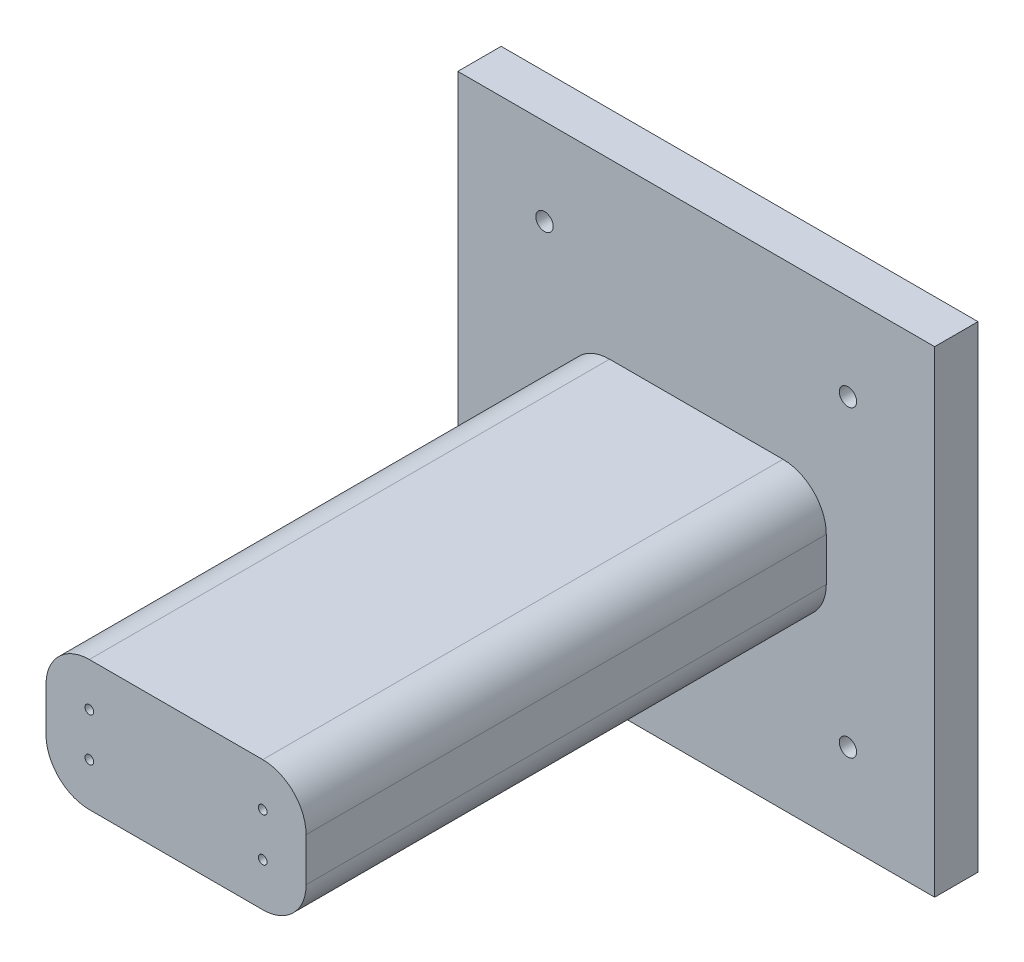
ISO-10303-21;
HEADER;
FILE_DESCRIPTION(('STEP AP214'),'2;1');
FILE_NAME('part.step','',(''),(''),'','','');
FILE_SCHEMA(('AUTOMOTIVE_DESIGN { 1 0 10303 214 1 1 1 1 }'));
ENDSEC;
DATA;
#1=APPLICATION_CONTEXT('core data for automotive mechanical design processes');
#2=APPLICATION_PROTOCOL_DEFINITION('international standard','automotive_design',2000,#1);
#3=PRODUCT_CONTEXT('',#1,'mechanical');
#4=PRODUCT('Part','Part','',(#3));
#5=PRODUCT_RELATED_PRODUCT_CATEGORY('part','',(#4));
#6=PRODUCT_DEFINITION_FORMATION('','',#4);
#7=PRODUCT_DEFINITION_CONTEXT('part definition',#1,'design');
#8=PRODUCT_DEFINITION('design','',#6,#7);
#9=PRODUCT_DEFINITION_SHAPE('','',#8);
#10=(LENGTH_UNIT() NAMED_UNIT(*) SI_UNIT(.MILLI.,.METRE.));
#11=(NAMED_UNIT(*) PLANE_ANGLE_UNIT() SI_UNIT($,.RADIAN.));
#12=(NAMED_UNIT(*) SI_UNIT($,.STERADIAN.) SOLID_ANGLE_UNIT());
#13=UNCERTAINTY_MEASURE_WITH_UNIT(LENGTH_MEASURE(1.E-05),#10,'distance_accuracy_value','');
#14=(GEOMETRIC_REPRESENTATION_CONTEXT(3) GLOBAL_UNCERTAINTY_ASSIGNED_CONTEXT((#13)) GLOBAL_UNIT_ASSIGNED_CONTEXT((#10,
#11,#12)) REPRESENTATION_CONTEXT('',''));
#15=CARTESIAN_POINT('',(0.,0.,0.));
#16=DIRECTION('',(0.,0.,1.));
#17=DIRECTION('',(1.,0.,0.));
#18=AXIS2_PLACEMENT_3D('',#15,#16,#17);
#19=CARTESIAN_POINT('',(-10.,2.5,65.));
#20=DIRECTION('',(0.,0.,-1.));
#21=DIRECTION('',(-1.,0.,0.));
#22=AXIS2_PLACEMENT_3D('',#19,#20,#21);
#23=CYLINDRICAL_SURFACE('',#22,5.);
#24=DIRECTION('',(0.,0.,-1.));
#25=VECTOR('',#24,1.);
#26=CARTESIAN_POINT('',(-15.,2.5,65.));
#27=LINE('',#26,#25);
#28=CARTESIAN_POINT('',(-15.,2.5,65.));
#29=VERTEX_POINT('',#28);
#30=CARTESIAN_POINT('',(-15.,2.5,5.));
#31=VERTEX_POINT('',#30);
#32=EDGE_CURVE('E202',#29,#31,#27,.T.);
#33=ORIENTED_EDGE('',*,*,#32,.F.);
#34=CARTESIAN_POINT('',(-10.,2.5,65.));
#35=DIRECTION('',(0.,0.,1.));
#36=DIRECTION('',(1.,0.,0.));
#37=AXIS2_PLACEMENT_3D('',#34,#35,#36);
#38=CIRCLE('',#37,5.);
#39=CARTESIAN_POINT('',(-10.,7.5,65.));
#40=VERTEX_POINT('',#39);
#41=EDGE_CURVE('E47',#40,#29,#38,.T.);
#42=ORIENTED_EDGE('',*,*,#41,.F.);
#43=DIRECTION('',(0.,0.,-1.));
#44=VECTOR('',#43,1.);
#45=CARTESIAN_POINT('',(-10.,7.5,65.));
#46=LINE('',#45,#44);
#47=CARTESIAN_POINT('',(-10.,7.5,5.));
#48=VERTEX_POINT('',#47);
#49=EDGE_CURVE('E206',#48,#40,#46,.F.);
#50=ORIENTED_EDGE('',*,*,#49,.F.);
#51=CARTESIAN_POINT('',(-10.,2.5,5.));
#52=DIRECTION('',(0.,0.,1.));
#53=DIRECTION('',(1.,0.,0.));
#54=AXIS2_PLACEMENT_3D('',#51,#52,#53);
#55=CIRCLE('',#54,5.);
#56=EDGE_CURVE('E11',#48,#31,#55,.T.);
#57=ORIENTED_EDGE('',*,*,#56,.T.);
#58=EDGE_LOOP('',(#33,#42,#50,#57));
#59=FACE_BOUND('',#58,.T.);
#60=ADVANCED_FACE('F39',(#59),#23,.T.);
#61=CARTESIAN_POINT('',(10.,-2.5,65.));
#62=DIRECTION('',(0.,0.,1.));
#63=DIRECTION('',(1.,0.,0.));
#64=AXIS2_PLACEMENT_3D('',#61,#62,#63);
#65=CYLINDRICAL_SURFACE('',#64,5.);
#66=DIRECTION('',(0.,0.,1.));
#67=VECTOR('',#66,1.);
#68=CARTESIAN_POINT('',(10.,-7.5,65.));
#69=LINE('',#68,#67);
#70=CARTESIAN_POINT('',(10.,-7.5,5.));
#71=VERTEX_POINT('',#70);
#72=CARTESIAN_POINT('',(10.,-7.5,65.));
#73=VERTEX_POINT('',#72);
#74=EDGE_CURVE('E188',#71,#73,#69,.T.);
#75=ORIENTED_EDGE('',*,*,#74,.F.);
#76=CARTESIAN_POINT('',(10.,-2.5,5.));
#77=DIRECTION('',(0.,0.,1.));
#78=DIRECTION('',(1.,0.,0.));
#79=AXIS2_PLACEMENT_3D('',#76,#77,#78);
#80=CIRCLE('',#79,5.);
#81=CARTESIAN_POINT('',(15.,-2.5,5.));
#82=VERTEX_POINT('',#81);
#83=EDGE_CURVE('E199',#71,#82,#80,.T.);
#84=ORIENTED_EDGE('',*,*,#83,.T.);
#85=DIRECTION('',(0.,0.,1.));
#86=VECTOR('',#85,1.);
#87=CARTESIAN_POINT('',(15.,-2.5,65.));
#88=LINE('',#87,#86);
#89=CARTESIAN_POINT('',(15.,-2.5,65.));
#90=VERTEX_POINT('',#89);
#91=EDGE_CURVE('E192',#90,#82,#88,.F.);
#92=ORIENTED_EDGE('',*,*,#91,.F.);
#93=CARTESIAN_POINT('',(10.,-2.5,65.));
#94=DIRECTION('',(0.,0.,1.));
#95=DIRECTION('',(1.,0.,0.));
#96=AXIS2_PLACEMENT_3D('',#93,#94,#95);
#97=CIRCLE('',#96,5.);
#98=EDGE_CURVE('E196',#73,#90,#97,.T.);
#99=ORIENTED_EDGE('',*,*,#98,.F.);
#100=EDGE_LOOP('',(#75,#84,#92,#99));
#101=FACE_BOUND('',#100,.T.);
#102=ADVANCED_FACE('F282',(#101),#65,.T.);
#103=CARTESIAN_POINT('',(10.,2.5,65.));
#104=DIRECTION('',(0.,0.,1.));
#105=DIRECTION('',(1.,0.,0.));
#106=AXIS2_PLACEMENT_3D('',#103,#104,#105);
#107=CYLINDRICAL_SURFACE('',#106,5.);
#108=DIRECTION('',(0.,0.,1.));
#109=VECTOR('',#108,1.);
#110=CARTESIAN_POINT('',(15.,2.5,65.));
#111=LINE('',#110,#109);
#112=CARTESIAN_POINT('',(15.,2.5,5.));
#113=VERTEX_POINT('',#112);
#114=CARTESIAN_POINT('',(15.,2.5,65.));
#115=VERTEX_POINT('',#114);
#116=EDGE_CURVE('E174',#113,#115,#111,.T.);
#117=ORIENTED_EDGE('',*,*,#116,.F.);
#118=CARTESIAN_POINT('',(10.,2.5,5.));
#119=DIRECTION('',(0.,0.,1.));
#120=DIRECTION('',(1.,0.,0.));
#121=AXIS2_PLACEMENT_3D('',#118,#119,#120);
#122=CIRCLE('',#121,5.);
#123=CARTESIAN_POINT('',(10.,7.5,5.));
#124=VERTEX_POINT('',#123);
#125=EDGE_CURVE('E185',#113,#124,#122,.T.);
#126=ORIENTED_EDGE('',*,*,#125,.T.);
#127=DIRECTION('',(0.,0.,1.));
#128=VECTOR('',#127,1.);
#129=CARTESIAN_POINT('',(10.,7.5,65.));
#130=LINE('',#129,#128);
#131=CARTESIAN_POINT('',(10.,7.5,65.));
#132=VERTEX_POINT('',#131);
#133=EDGE_CURVE('E178',#132,#124,#130,.F.);
#134=ORIENTED_EDGE('',*,*,#133,.F.);
#135=CARTESIAN_POINT('',(10.,2.5,65.));
#136=DIRECTION('',(0.,0.,1.));
#137=DIRECTION('',(1.,0.,0.));
#138=AXIS2_PLACEMENT_3D('',#135,#136,#137);
#139=CIRCLE('',#138,5.);
#140=EDGE_CURVE('E182',#115,#132,#139,.T.);
#141=ORIENTED_EDGE('',*,*,#140,.F.);
#142=EDGE_LOOP('',(#117,#126,#134,#141));
#143=FACE_BOUND('',#142,.T.);
#144=ADVANCED_FACE('F286',(#143),#107,.T.);
#145=CARTESIAN_POINT('',(-10.,-2.5,65.));
#146=DIRECTION('',(0.,0.,1.));
#147=DIRECTION('',(1.,0.,0.));
#148=AXIS2_PLACEMENT_3D('',#145,#146,#147);
#149=CYLINDRICAL_SURFACE('',#148,5.);
#150=DIRECTION('',(0.,0.,1.));
#151=VECTOR('',#150,1.);
#152=CARTESIAN_POINT('',(-15.,-2.5,65.));
#153=LINE('',#152,#151);
#154=CARTESIAN_POINT('',(-15.,-2.5,5.));
#155=VERTEX_POINT('',#154);
#156=CARTESIAN_POINT('',(-15.,-2.5,65.));
#157=VERTEX_POINT('',#156);
#158=EDGE_CURVE('E154',#155,#157,#153,.T.);
#159=ORIENTED_EDGE('',*,*,#158,.F.);
#160=CARTESIAN_POINT('',(-10.,-2.5,5.));
#161=DIRECTION('',(0.,0.,1.));
#162=DIRECTION('',(1.,0.,0.));
#163=AXIS2_PLACEMENT_3D('',#160,#161,#162);
#164=CIRCLE('',#163,5.);
#165=CARTESIAN_POINT('',(-10.,-7.5,5.));
#166=VERTEX_POINT('',#165);
#167=EDGE_CURVE('E171',#155,#166,#164,.T.);
#168=ORIENTED_EDGE('',*,*,#167,.T.);
#169=DIRECTION('',(0.,0.,1.));
#170=VECTOR('',#169,1.);
#171=CARTESIAN_POINT('',(-10.,-7.5,65.));
#172=LINE('',#171,#170);
#173=CARTESIAN_POINT('',(-10.,-7.5,65.));
#174=VERTEX_POINT('',#173);
#175=EDGE_CURVE('E159',#174,#166,#172,.F.);
#176=ORIENTED_EDGE('',*,*,#175,.F.);
#177=CARTESIAN_POINT('',(-10.,-2.5,65.));
#178=DIRECTION('',(0.,0.,1.));
#179=DIRECTION('',(1.,0.,0.));
#180=AXIS2_PLACEMENT_3D('',#177,#178,#179);
#181=CIRCLE('',#180,5.);
#182=EDGE_CURVE('E168',#157,#174,#181,.T.);
#183=ORIENTED_EDGE('',*,*,#182,.F.);
#184=EDGE_LOOP('',(#159,#168,#176,#183));
#185=FACE_BOUND('',#184,.T.);
#186=ADVANCED_FACE('F291',(#185),#149,.T.);
#187=CARTESIAN_POINT('',(27.5,27.5,5.));
#188=DIRECTION('',(-1.,0.,0.));
#189=DIRECTION('',(0.,-1.,0.));
#190=AXIS2_PLACEMENT_3D('',#187,#188,#189);
#191=PLANE('',#190);
#192=DIRECTION('',(0.,1.,0.));
#193=VECTOR('',#192,1.);
#194=CARTESIAN_POINT('',(27.5,27.5,0.));
#195=LINE('',#194,#193);
#196=CARTESIAN_POINT('',(27.5,-27.5,0.));
#197=VERTEX_POINT('',#196);
#198=CARTESIAN_POINT('',(27.5,27.5,0.));
#199=VERTEX_POINT('',#198);
#200=EDGE_CURVE('E152',#197,#199,#195,.T.);
#201=ORIENTED_EDGE('',*,*,#200,.T.);
#202=DIRECTION('',(0.,0.,-1.));
#203=VECTOR('',#202,1.);
#204=CARTESIAN_POINT('',(27.5,27.5,5.));
#205=LINE('',#204,#203);
#206=CARTESIAN_POINT('',(27.5,27.5,5.));
#207=VERTEX_POINT('',#206);
#208=EDGE_CURVE('E130',#207,#199,#205,.T.);
#209=ORIENTED_EDGE('',*,*,#208,.F.);
#210=DIRECTION('',(0.,1.,0.));
#211=VECTOR('',#210,1.);
#212=CARTESIAN_POINT('',(27.5,27.5,5.));
#213=LINE('',#212,#211);
#214=CARTESIAN_POINT('',(27.5,-27.5,5.));
#215=VERTEX_POINT('',#214);
#216=EDGE_CURVE('E138',#215,#207,#213,.T.);
#217=ORIENTED_EDGE('',*,*,#216,.F.);
#218=DIRECTION('',(0.,0.,-1.));
#219=VECTOR('',#218,1.);
#220=CARTESIAN_POINT('',(27.5,-27.5,5.));
#221=LINE('',#220,#219);
#222=EDGE_CURVE('E250',#215,#197,#221,.T.);
#223=ORIENTED_EDGE('',*,*,#222,.T.);
#224=EDGE_LOOP('',(#201,#209,#217,#223));
#225=FACE_BOUND('',#224,.T.);
#226=ADVANCED_FACE('F150',(#225),#191,.F.);
#227=CARTESIAN_POINT('',(-27.5,27.5,5.));
#228=DIRECTION('',(0.,-1.,0.));
#229=DIRECTION('',(0.,0.,-1.));
#230=AXIS2_PLACEMENT_3D('',#227,#228,#229);
#231=PLANE('',#230);
#232=DIRECTION('',(-1.,0.,0.));
#233=VECTOR('',#232,1.);
#234=CARTESIAN_POINT('',(-27.5,27.5,0.));
#235=LINE('',#234,#233);
#236=CARTESIAN_POINT('',(-27.5,27.5,0.));
#237=VERTEX_POINT('',#236);
#238=EDGE_CURVE('E253',#199,#237,#235,.T.);
#239=ORIENTED_EDGE('',*,*,#238,.T.);
#240=DIRECTION('',(0.,0.,-1.));
#241=VECTOR('',#240,1.);
#242=CARTESIAN_POINT('',(-27.5,27.5,5.));
#243=LINE('',#242,#241);
#244=CARTESIAN_POINT('',(-27.5,27.5,5.));
#245=VERTEX_POINT('',#244);
#246=EDGE_CURVE('E133',#245,#237,#243,.T.);
#247=ORIENTED_EDGE('',*,*,#246,.F.);
#248=DIRECTION('',(-1.,0.,0.));
#249=VECTOR('',#248,1.);
#250=CARTESIAN_POINT('',(-27.5,27.5,5.));
#251=LINE('',#250,#249);
#252=EDGE_CURVE('E126',#207,#245,#251,.T.);
#253=ORIENTED_EDGE('',*,*,#252,.F.);
#254=ORIENTED_EDGE('',*,*,#208,.T.);
#255=EDGE_LOOP('',(#239,#247,#253,#254));
#256=FACE_BOUND('',#255,.T.);
#257=ADVANCED_FACE('F128',(#256),#231,.F.);
#258=CARTESIAN_POINT('',(-27.5,27.5,5.));
#259=DIRECTION('',(1.,0.,0.));
#260=DIRECTION('',(0.,1.,0.));
#261=AXIS2_PLACEMENT_3D('',#258,#259,#260);
#262=PLANE('',#261);
#263=DIRECTION('',(0.,-1.,0.));
#264=VECTOR('',#263,1.);
#265=CARTESIAN_POINT('',(-27.5,27.5,0.));
#266=LINE('',#265,#264);
#267=CARTESIAN_POINT('',(-27.5,-27.5,0.));
#268=VERTEX_POINT('',#267);
#269=EDGE_CURVE('E256',#237,#268,#266,.T.);
#270=ORIENTED_EDGE('',*,*,#269,.T.);
#271=DIRECTION('',(0.,0.,-1.));
#272=VECTOR('',#271,1.);
#273=CARTESIAN_POINT('',(-27.5,-27.5,5.));
#274=LINE('',#273,#272);
#275=CARTESIAN_POINT('',(-27.5,-27.5,5.));
#276=VERTEX_POINT('',#275);
#277=EDGE_CURVE('E161',#276,#268,#274,.T.);
#278=ORIENTED_EDGE('',*,*,#277,.F.);
#279=DIRECTION('',(0.,-1.,0.));
#280=VECTOR('',#279,1.);
#281=CARTESIAN_POINT('',(-27.5,27.5,5.));
#282=LINE('',#281,#280);
#283=EDGE_CURVE('E137',#245,#276,#282,.T.);
#284=ORIENTED_EDGE('',*,*,#283,.F.);
#285=ORIENTED_EDGE('',*,*,#246,.T.);
#286=EDGE_LOOP('',(#270,#278,#284,#285));
#287=FACE_BOUND('',#286,.T.);
#288=ADVANCED_FACE('F272',(#287),#262,.F.);
#289=CARTESIAN_POINT('',(-27.5,-27.5,5.));
#290=DIRECTION('',(0.,1.,0.));
#291=DIRECTION('',(0.,0.,1.));
#292=AXIS2_PLACEMENT_3D('',#289,#290,#291);
#293=PLANE('',#292);
#294=DIRECTION('',(1.,0.,0.));
#295=VECTOR('',#294,1.);
#296=CARTESIAN_POINT('',(-27.5,-27.5,0.));
#297=LINE('',#296,#295);
#298=EDGE_CURVE('E148',#268,#197,#297,.T.);
#299=ORIENTED_EDGE('',*,*,#298,.T.);
#300=ORIENTED_EDGE('',*,*,#222,.F.);
#301=DIRECTION('',(1.,0.,0.));
#302=VECTOR('',#301,1.);
#303=CARTESIAN_POINT('',(-27.5,-27.5,5.));
#304=LINE('',#303,#302);
#305=EDGE_CURVE('E143',#276,#215,#304,.T.);
#306=ORIENTED_EDGE('',*,*,#305,.F.);
#307=ORIENTED_EDGE('',*,*,#277,.T.);
#308=EDGE_LOOP('',(#299,#300,#306,#307));
#309=FACE_BOUND('',#308,.T.);
#310=ADVANCED_FACE('F267',(#309),#293,.F.);
#311=CARTESIAN_POINT('',(0.,0.,5.));
#312=DIRECTION('',(0.,0.,1.));
#313=DIRECTION('',(1.,0.,0.));
#314=AXIS2_PLACEMENT_3D('',#311,#312,#313);
#315=PLANE('',#314);
#316=CARTESIAN_POINT('',(17.5,-17.5,5.));
#317=DIRECTION('',(0.,0.,1.));
#318=DIRECTION('',(1.,0.,0.));
#319=AXIS2_PLACEMENT_3D('',#316,#317,#318);
#320=CIRCLE('',#319,1.);
#321=CARTESIAN_POINT('',(18.5,-17.5,5.));
#322=VERTEX_POINT('',#321);
#323=EDGE_CURVE('E545',#322,#322,#320,.T.);
#324=ORIENTED_EDGE('',*,*,#323,.F.);
#325=EDGE_LOOP('',(#324));
#326=FACE_BOUND('',#325,.T.);
#327=CARTESIAN_POINT('',(-17.5,-17.5,5.));
#328=DIRECTION('',(0.,0.,1.));
#329=DIRECTION('',(1.,0.,0.));
#330=AXIS2_PLACEMENT_3D('',#327,#328,#329);
#331=CIRCLE('',#330,1.);
#332=CARTESIAN_POINT('',(-16.5,-17.5,5.));
#333=VERTEX_POINT('',#332);
#334=EDGE_CURVE('E561',#333,#333,#331,.T.);
#335=ORIENTED_EDGE('',*,*,#334,.F.);
#336=EDGE_LOOP('',(#335));
#337=FACE_BOUND('',#336,.T.);
#338=CARTESIAN_POINT('',(-17.5,17.5,5.));
#339=DIRECTION('',(0.,0.,1.));
#340=DIRECTION('',(1.,0.,0.));
#341=AXIS2_PLACEMENT_3D('',#338,#339,#340);
#342=CIRCLE('',#341,1.);
#343=CARTESIAN_POINT('',(-16.5,17.5,5.));
#344=VERTEX_POINT('',#343);
#345=EDGE_CURVE('E551',#344,#344,#342,.T.);
#346=ORIENTED_EDGE('',*,*,#345,.F.);
#347=EDGE_LOOP('',(#346));
#348=FACE_BOUND('',#347,.T.);
#349=CARTESIAN_POINT('',(17.5,17.5,5.));
#350=DIRECTION('',(0.,0.,1.));
#351=DIRECTION('',(1.,0.,0.));
#352=AXIS2_PLACEMENT_3D('',#349,#350,#351);
#353=CIRCLE('',#352,1.);
#354=CARTESIAN_POINT('',(18.5,17.5,5.));
#355=VERTEX_POINT('',#354);
#356=EDGE_CURVE('E560',#355,#355,#353,.T.);
#357=ORIENTED_EDGE('',*,*,#356,.F.);
#358=EDGE_LOOP('',(#357));
#359=FACE_BOUND('',#358,.T.);
#360=DIRECTION('',(0.,1.,0.));
#361=VECTOR('',#360,1.);
#362=CARTESIAN_POINT('',(15.,7.5,5.));
#363=LINE('',#362,#361);
#364=EDGE_CURVE('E231',#82,#113,#363,.T.);
#365=ORIENTED_EDGE('',*,*,#364,.F.);
#366=ORIENTED_EDGE('',*,*,#83,.F.);
#367=DIRECTION('',(1.,0.,0.));
#368=VECTOR('',#367,1.);
#369=CARTESIAN_POINT('',(-15.,-7.5,5.));
#370=LINE('',#369,#368);
#371=EDGE_CURVE('E242',#166,#71,#370,.T.);
#372=ORIENTED_EDGE('',*,*,#371,.F.);
#373=ORIENTED_EDGE('',*,*,#167,.F.);
#374=DIRECTION('',(0.,-1.,0.));
#375=VECTOR('',#374,1.);
#376=CARTESIAN_POINT('',(-15.,7.5,5.));
#377=LINE('',#376,#375);
#378=EDGE_CURVE('E239',#31,#155,#377,.T.);
#379=ORIENTED_EDGE('',*,*,#378,.F.);
#380=ORIENTED_EDGE('',*,*,#56,.F.);
#381=DIRECTION('',(-1.,0.,0.));
#382=VECTOR('',#381,1.);
#383=CARTESIAN_POINT('',(-15.,7.5,5.));
#384=LINE('',#383,#382);
#385=EDGE_CURVE('E234',#124,#48,#384,.T.);
#386=ORIENTED_EDGE('',*,*,#385,.F.);
#387=ORIENTED_EDGE('',*,*,#125,.F.);
#388=EDGE_LOOP('',(#365,#366,#372,#373,#379,#380,#386,#387));
#389=FACE_BOUND('',#388,.T.);
#390=ORIENTED_EDGE('',*,*,#216,.T.);
#391=ORIENTED_EDGE('',*,*,#252,.T.);
#392=ORIENTED_EDGE('',*,*,#283,.T.);
#393=ORIENTED_EDGE('',*,*,#305,.T.);
#394=EDGE_LOOP('',(#390,#391,#392,#393));
#395=FACE_BOUND('',#394,.T.);
#396=ADVANCED_FACE('F141',(#326,#337,#348,#359,#389,#395),#315,.T.);
#397=CARTESIAN_POINT('',(0.,0.,0.));
#398=DIRECTION('',(0.,0.,1.));
#399=DIRECTION('',(1.,0.,0.));
#400=AXIS2_PLACEMENT_3D('',#397,#398,#399);
#401=PLANE('',#400);
#402=CARTESIAN_POINT('',(17.5,-17.5,0.));
#403=DIRECTION('',(0.,0.,1.));
#404=DIRECTION('',(1.,0.,0.));
#405=AXIS2_PLACEMENT_3D('',#402,#403,#404);
#406=CIRCLE('',#405,1.);
#407=CARTESIAN_POINT('',(18.5,-17.5,0.));
#408=VERTEX_POINT('',#407);
#409=EDGE_CURVE('E565',#408,#408,#406,.F.);
#410=ORIENTED_EDGE('',*,*,#409,.F.);
#411=EDGE_LOOP('',(#410));
#412=FACE_BOUND('',#411,.T.);
#413=CARTESIAN_POINT('',(-17.5,-17.5,0.));
#414=DIRECTION('',(0.,0.,1.));
#415=DIRECTION('',(1.,0.,0.));
#416=AXIS2_PLACEMENT_3D('',#413,#414,#415);
#417=CIRCLE('',#416,1.);
#418=CARTESIAN_POINT('',(-16.5,-17.5,0.));
#419=VERTEX_POINT('',#418);
#420=EDGE_CURVE('E556',#419,#419,#417,.F.);
#421=ORIENTED_EDGE('',*,*,#420,.F.);
#422=EDGE_LOOP('',(#421));
#423=FACE_BOUND('',#422,.T.);
#424=CARTESIAN_POINT('',(-17.5,17.5,0.));
#425=DIRECTION('',(0.,0.,1.));
#426=DIRECTION('',(1.,0.,0.));
#427=AXIS2_PLACEMENT_3D('',#424,#425,#426);
#428=CIRCLE('',#427,1.);
#429=CARTESIAN_POINT('',(-16.5,17.5,0.));
#430=VERTEX_POINT('',#429);
#431=EDGE_CURVE('E555',#430,#430,#428,.F.);
#432=ORIENTED_EDGE('',*,*,#431,.F.);
#433=EDGE_LOOP('',(#432));
#434=FACE_BOUND('',#433,.T.);
#435=CARTESIAN_POINT('',(17.5,17.5,0.));
#436=DIRECTION('',(0.,0.,1.));
#437=DIRECTION('',(1.,0.,0.));
#438=AXIS2_PLACEMENT_3D('',#435,#436,#437);
#439=CIRCLE('',#438,1.);
#440=CARTESIAN_POINT('',(18.5,17.5,0.));
#441=VERTEX_POINT('',#440);
#442=EDGE_CURVE('E235',#441,#441,#439,.F.);
#443=ORIENTED_EDGE('',*,*,#442,.F.);
#444=EDGE_LOOP('',(#443));
#445=FACE_BOUND('',#444,.T.);
#446=ORIENTED_EDGE('',*,*,#200,.F.);
#447=ORIENTED_EDGE('',*,*,#298,.F.);
#448=ORIENTED_EDGE('',*,*,#269,.F.);
#449=ORIENTED_EDGE('',*,*,#238,.F.);
#450=EDGE_LOOP('',(#446,#447,#448,#449));
#451=FACE_BOUND('',#450,.T.);
#452=ADVANCED_FACE('F271',(#412,#423,#434,#445,#451),#401,.F.);
#453=CARTESIAN_POINT('',(15.,7.5,65.));
#454=DIRECTION('',(-1.,0.,0.));
#455=DIRECTION('',(0.,-1.,0.));
#456=AXIS2_PLACEMENT_3D('',#453,#454,#455);
#457=PLANE('',#456);
#458=DIRECTION('',(0.,1.,0.));
#459=VECTOR('',#458,1.);
#460=CARTESIAN_POINT('',(15.,7.5,65.));
#461=LINE('',#460,#459);
#462=EDGE_CURVE('E227',#90,#115,#461,.T.);
#463=ORIENTED_EDGE('',*,*,#462,.F.);
#464=ORIENTED_EDGE('',*,*,#91,.T.);
#465=ORIENTED_EDGE('',*,*,#364,.T.);
#466=ORIENTED_EDGE('',*,*,#116,.T.);
#467=EDGE_LOOP('',(#463,#464,#465,#466));
#468=FACE_BOUND('',#467,.T.);
#469=ADVANCED_FACE('F341',(#468),#457,.F.);
#470=CARTESIAN_POINT('',(-15.,7.5,65.));
#471=DIRECTION('',(0.,-1.,0.));
#472=DIRECTION('',(0.,0.,-1.));
#473=AXIS2_PLACEMENT_3D('',#470,#471,#472);
#474=PLANE('',#473);
#475=ORIENTED_EDGE('',*,*,#385,.T.);
#476=ORIENTED_EDGE('',*,*,#49,.T.);
#477=DIRECTION('',(-1.,0.,0.));
#478=VECTOR('',#477,1.);
#479=CARTESIAN_POINT('',(-15.,7.5,65.));
#480=LINE('',#479,#478);
#481=EDGE_CURVE('E216',#132,#40,#480,.T.);
#482=ORIENTED_EDGE('',*,*,#481,.F.);
#483=ORIENTED_EDGE('',*,*,#133,.T.);
#484=EDGE_LOOP('',(#475,#476,#482,#483));
#485=FACE_BOUND('',#484,.T.);
#486=ADVANCED_FACE('F346',(#485),#474,.F.);
#487=CARTESIAN_POINT('',(-15.,7.5,65.));
#488=DIRECTION('',(1.,0.,0.));
#489=DIRECTION('',(0.,1.,0.));
#490=AXIS2_PLACEMENT_3D('',#487,#488,#489);
#491=PLANE('',#490);
#492=DIRECTION('',(0.,-1.,0.));
#493=VECTOR('',#492,1.);
#494=CARTESIAN_POINT('',(-15.,7.5,65.));
#495=LINE('',#494,#493);
#496=EDGE_CURVE('E213',#29,#157,#495,.T.);
#497=ORIENTED_EDGE('',*,*,#496,.F.);
#498=ORIENTED_EDGE('',*,*,#32,.T.);
#499=ORIENTED_EDGE('',*,*,#378,.T.);
#500=ORIENTED_EDGE('',*,*,#158,.T.);
#501=EDGE_LOOP('',(#497,#498,#499,#500));
#502=FACE_BOUND('',#501,.T.);
#503=ADVANCED_FACE('F218',(#502),#491,.F.);
#504=CARTESIAN_POINT('',(-15.,-7.5,65.));
#505=DIRECTION('',(0.,1.,0.));
#506=DIRECTION('',(0.,0.,1.));
#507=AXIS2_PLACEMENT_3D('',#504,#505,#506);
#508=PLANE('',#507);
#509=ORIENTED_EDGE('',*,*,#371,.T.);
#510=ORIENTED_EDGE('',*,*,#74,.T.);
#511=DIRECTION('',(1.,0.,0.));
#512=VECTOR('',#511,1.);
#513=CARTESIAN_POINT('',(-15.,-7.5,65.));
#514=LINE('',#513,#512);
#515=EDGE_CURVE('E221',#174,#73,#514,.T.);
#516=ORIENTED_EDGE('',*,*,#515,.F.);
#517=ORIENTED_EDGE('',*,*,#175,.T.);
#518=EDGE_LOOP('',(#509,#510,#516,#517));
#519=FACE_BOUND('',#518,.T.);
#520=ADVANCED_FACE('F356',(#519),#508,.F.);
#521=CARTESIAN_POINT('',(0.,0.,65.));
#522=DIRECTION('',(0.,0.,1.));
#523=DIRECTION('',(1.,0.,0.));
#524=AXIS2_PLACEMENT_3D('',#521,#522,#523);
#525=PLANE('',#524);
#526=CARTESIAN_POINT('',(-10.,-2.5,65.));
#527=DIRECTION('',(0.,0.,1.));
#528=DIRECTION('',(1.,0.,0.));
#529=AXIS2_PLACEMENT_3D('',#526,#527,#528);
#530=CIRCLE('',#529,0.500000000000001);
#531=CARTESIAN_POINT('',(-9.5,-2.5,65.));
#532=VERTEX_POINT('',#531);
#533=EDGE_CURVE('E530',#532,#532,#530,.T.);
#534=ORIENTED_EDGE('',*,*,#533,.F.);
#535=EDGE_LOOP('',(#534));
#536=FACE_BOUND('',#535,.T.);
#537=CARTESIAN_POINT('',(-10.,2.5,65.));
#538=DIRECTION('',(0.,0.,1.));
#539=DIRECTION('',(1.,0.,0.));
#540=AXIS2_PLACEMENT_3D('',#537,#538,#539);
#541=CIRCLE('',#540,0.500000000000001);
#542=CARTESIAN_POINT('',(-9.5,2.5,65.));
#543=VERTEX_POINT('',#542);
#544=EDGE_CURVE('E529',#543,#543,#541,.T.);
#545=ORIENTED_EDGE('',*,*,#544,.F.);
#546=EDGE_LOOP('',(#545));
#547=FACE_BOUND('',#546,.T.);
#548=CARTESIAN_POINT('',(10.,2.5,65.));
#549=DIRECTION('',(0.,0.,1.));
#550=DIRECTION('',(1.,0.,0.));
#551=AXIS2_PLACEMENT_3D('',#548,#549,#550);
#552=CIRCLE('',#551,0.500000000000001);
#553=CARTESIAN_POINT('',(10.5,2.5,65.));
#554=VERTEX_POINT('',#553);
#555=EDGE_CURVE('E595',#554,#554,#552,.T.);
#556=ORIENTED_EDGE('',*,*,#555,.F.);
#557=EDGE_LOOP('',(#556));
#558=FACE_BOUND('',#557,.T.);
#559=CARTESIAN_POINT('',(10.,-2.5,65.));
#560=DIRECTION('',(0.,0.,1.));
#561=DIRECTION('',(1.,0.,0.));
#562=AXIS2_PLACEMENT_3D('',#559,#560,#561);
#563=CIRCLE('',#562,0.500000000000001);
#564=CARTESIAN_POINT('',(10.5,-2.5,65.));
#565=VERTEX_POINT('',#564);
#566=EDGE_CURVE('E546',#565,#565,#563,.T.);
#567=ORIENTED_EDGE('',*,*,#566,.F.);
#568=EDGE_LOOP('',(#567));
#569=FACE_BOUND('',#568,.T.);
#570=ORIENTED_EDGE('',*,*,#481,.T.);
#571=ORIENTED_EDGE('',*,*,#41,.T.);
#572=ORIENTED_EDGE('',*,*,#496,.T.);
#573=ORIENTED_EDGE('',*,*,#182,.T.);
#574=ORIENTED_EDGE('',*,*,#515,.T.);
#575=ORIENTED_EDGE('',*,*,#98,.T.);
#576=ORIENTED_EDGE('',*,*,#462,.T.);
#577=ORIENTED_EDGE('',*,*,#140,.T.);
#578=EDGE_LOOP('',(#570,#571,#572,#573,#574,#575,#576,#577));
#579=FACE_BOUND('',#578,.T.);
#580=ADVANCED_FACE('F211',(#536,#547,#558,#569,#579),#525,.T.);
#581=CARTESIAN_POINT('',(17.5,17.5,-0.00100000000000013));
#582=DIRECTION('',(0.,0.,1.));
#583=DIRECTION('',(1.,0.,0.));
#584=AXIS2_PLACEMENT_3D('',#581,#582,#583);
#585=CYLINDRICAL_SURFACE('',#584,1.);
#586=ORIENTED_EDGE('',*,*,#356,.T.);
#587=EDGE_LOOP('',(#586));
#588=FACE_BOUND('',#587,.T.);
#589=ORIENTED_EDGE('',*,*,#442,.T.);
#590=EDGE_LOOP('',(#589));
#591=FACE_BOUND('',#590,.T.);
#592=ADVANCED_FACE('F400',(#588,#591),#585,.F.);
#593=CARTESIAN_POINT('',(-17.5,17.5,-0.00100000000000013));
#594=DIRECTION('',(0.,0.,1.));
#595=DIRECTION('',(1.,0.,0.));
#596=AXIS2_PLACEMENT_3D('',#593,#594,#595);
#597=CYLINDRICAL_SURFACE('',#596,1.);
#598=ORIENTED_EDGE('',*,*,#345,.T.);
#599=EDGE_LOOP('',(#598));
#600=FACE_BOUND('',#599,.T.);
#601=ORIENTED_EDGE('',*,*,#431,.T.);
#602=EDGE_LOOP('',(#601));
#603=FACE_BOUND('',#602,.T.);
#604=ADVANCED_FACE('F404',(#600,#603),#597,.F.);
#605=CARTESIAN_POINT('',(-17.5,-17.5,-0.00100000000000013));
#606=DIRECTION('',(0.,0.,1.));
#607=DIRECTION('',(1.,0.,0.));
#608=AXIS2_PLACEMENT_3D('',#605,#606,#607);
#609=CYLINDRICAL_SURFACE('',#608,1.);
#610=ORIENTED_EDGE('',*,*,#334,.T.);
#611=EDGE_LOOP('',(#610));
#612=FACE_BOUND('',#611,.T.);
#613=ORIENTED_EDGE('',*,*,#420,.T.);
#614=EDGE_LOOP('',(#613));
#615=FACE_BOUND('',#614,.T.);
#616=ADVANCED_FACE('F414',(#612,#615),#609,.F.);
#617=CARTESIAN_POINT('',(17.5,-17.5,-0.00100000000000013));
#618=DIRECTION('',(0.,0.,1.));
#619=DIRECTION('',(1.,0.,0.));
#620=AXIS2_PLACEMENT_3D('',#617,#618,#619);
#621=CYLINDRICAL_SURFACE('',#620,1.);
#622=ORIENTED_EDGE('',*,*,#323,.T.);
#623=EDGE_LOOP('',(#622));
#624=FACE_BOUND('',#623,.T.);
#625=ORIENTED_EDGE('',*,*,#409,.T.);
#626=EDGE_LOOP('',(#625));
#627=FACE_BOUND('',#626,.T.);
#628=ADVANCED_FACE('F424',(#624,#627),#621,.F.);
#629=CARTESIAN_POINT('',(10.,-2.5,63.));
#630=DIRECTION('',(0.,0.,1.));
#631=DIRECTION('',(1.,0.,0.));
#632=AXIS2_PLACEMENT_3D('',#629,#630,#631);
#633=CYLINDRICAL_SURFACE('',#632,0.500000000000001);
#634=CARTESIAN_POINT('',(10.,-2.5,63.));
#635=DIRECTION('',(0.,0.,1.));
#636=DIRECTION('',(1.,0.,0.));
#637=AXIS2_PLACEMENT_3D('',#634,#635,#636);
#638=CIRCLE('',#637,0.500000000000001);
#639=CARTESIAN_POINT('',(10.5,-2.5,63.));
#640=VERTEX_POINT('',#639);
#641=EDGE_CURVE('E541',#640,#640,#638,.T.);
#642=ORIENTED_EDGE('',*,*,#641,.F.);
#643=EDGE_LOOP('',(#642));
#644=FACE_BOUND('',#643,.T.);
#645=ORIENTED_EDGE('',*,*,#566,.T.);
#646=EDGE_LOOP('',(#645));
#647=FACE_BOUND('',#646,.T.);
#648=ADVANCED_FACE('F434',(#644,#647),#633,.F.);
#649=CARTESIAN_POINT('',(10.,-2.5,63.));
#650=DIRECTION('',(0.,0.,1.));
#651=DIRECTION('',(1.,0.,0.));
#652=AXIS2_PLACEMENT_3D('',#649,#650,#651);
#653=PLANE('',#652);
#654=ORIENTED_EDGE('',*,*,#641,.T.);
#655=EDGE_LOOP('',(#654));
#656=FACE_BOUND('',#655,.T.);
#657=ADVANCED_FACE('F451',(#656),#653,.T.);
#658=CARTESIAN_POINT('',(10.,2.5,63.));
#659=DIRECTION('',(0.,0.,1.));
#660=DIRECTION('',(1.,0.,0.));
#661=AXIS2_PLACEMENT_3D('',#658,#659,#660);
#662=CYLINDRICAL_SURFACE('',#661,0.500000000000001);
#663=CARTESIAN_POINT('',(10.,2.5,63.));
#664=DIRECTION('',(0.,0.,1.));
#665=DIRECTION('',(1.,0.,0.));
#666=AXIS2_PLACEMENT_3D('',#663,#664,#665);
#667=CIRCLE('',#666,0.500000000000001);
#668=CARTESIAN_POINT('',(10.5,2.5,63.));
#669=VERTEX_POINT('',#668);
#670=EDGE_CURVE('E550',#669,#669,#667,.T.);
#671=ORIENTED_EDGE('',*,*,#670,.F.);
#672=EDGE_LOOP('',(#671));
#673=FACE_BOUND('',#672,.T.);
#674=ORIENTED_EDGE('',*,*,#555,.T.);
#675=EDGE_LOOP('',(#674));
#676=FACE_BOUND('',#675,.T.);
#677=ADVANCED_FACE('F461',(#673,#676),#662,.F.);
#678=CARTESIAN_POINT('',(10.,2.5,63.));
#679=DIRECTION('',(0.,0.,1.));
#680=DIRECTION('',(1.,0.,0.));
#681=AXIS2_PLACEMENT_3D('',#678,#679,#680);
#682=PLANE('',#681);
#683=ORIENTED_EDGE('',*,*,#670,.T.);
#684=EDGE_LOOP('',(#683));
#685=FACE_BOUND('',#684,.T.);
#686=ADVANCED_FACE('F471',(#685),#682,.T.);
#687=CARTESIAN_POINT('',(-10.,2.5,63.));
#688=DIRECTION('',(0.,0.,1.));
#689=DIRECTION('',(1.,0.,0.));
#690=AXIS2_PLACEMENT_3D('',#687,#688,#689);
#691=CYLINDRICAL_SURFACE('',#690,0.500000000000001);
#692=CARTESIAN_POINT('',(-10.,2.5,63.));
#693=DIRECTION('',(0.,0.,1.));
#694=DIRECTION('',(1.,0.,0.));
#695=AXIS2_PLACEMENT_3D('',#692,#693,#694);
#696=CIRCLE('',#695,0.500000000000001);
#697=CARTESIAN_POINT('',(-9.5,2.5,63.));
#698=VERTEX_POINT('',#697);
#699=EDGE_CURVE('E535',#698,#698,#696,.T.);
#700=ORIENTED_EDGE('',*,*,#699,.F.);
#701=EDGE_LOOP('',(#700));
#702=FACE_BOUND('',#701,.T.);
#703=ORIENTED_EDGE('',*,*,#544,.T.);
#704=EDGE_LOOP('',(#703));
#705=FACE_BOUND('',#704,.T.);
#706=ADVANCED_FACE('F481',(#702,#705),#691,.F.);
#707=CARTESIAN_POINT('',(-10.,2.5,63.));
#708=DIRECTION('',(0.,0.,1.));
#709=DIRECTION('',(1.,0.,0.));
#710=AXIS2_PLACEMENT_3D('',#707,#708,#709);
#711=PLANE('',#710);
#712=ORIENTED_EDGE('',*,*,#699,.T.);
#713=EDGE_LOOP('',(#712));
#714=FACE_BOUND('',#713,.T.);
#715=ADVANCED_FACE('F491',(#714),#711,.T.);
#716=CARTESIAN_POINT('',(-10.,-2.5,63.));
#717=DIRECTION('',(0.,0.,1.));
#718=DIRECTION('',(1.,0.,0.));
#719=AXIS2_PLACEMENT_3D('',#716,#717,#718);
#720=CYLINDRICAL_SURFACE('',#719,0.500000000000001);
#721=CARTESIAN_POINT('',(-10.,-2.5,63.));
#722=DIRECTION('',(0.,0.,1.));
#723=DIRECTION('',(1.,0.,0.));
#724=AXIS2_PLACEMENT_3D('',#721,#722,#723);
#725=CIRCLE('',#724,0.500000000000001);
#726=CARTESIAN_POINT('',(-9.5,-2.5,63.));
#727=VERTEX_POINT('',#726);
#728=EDGE_CURVE('E527',#727,#727,#725,.T.);
#729=ORIENTED_EDGE('',*,*,#728,.F.);
#730=EDGE_LOOP('',(#729));
#731=FACE_BOUND('',#730,.T.);
#732=ORIENTED_EDGE('',*,*,#533,.T.);
#733=EDGE_LOOP('',(#732));
#734=FACE_BOUND('',#733,.T.);
#735=ADVANCED_FACE('F501',(#731,#734),#720,.F.);
#736=CARTESIAN_POINT('',(-10.,-2.5,63.));
#737=DIRECTION('',(0.,0.,1.));
#738=DIRECTION('',(1.,0.,0.));
#739=AXIS2_PLACEMENT_3D('',#736,#737,#738);
#740=PLANE('',#739);
#741=ORIENTED_EDGE('',*,*,#728,.T.);
#742=EDGE_LOOP('',(#741));
#743=FACE_BOUND('',#742,.T.);
#744=ADVANCED_FACE('F511',(#743),#740,.T.);
#745=CLOSED_SHELL('',(#60,#102,#144,#186,#226,#257,#288,#310,#396,#452,#469,#486,#503,#520,#580,
#592,#604,#616,#628,#648,#657,#677,#686,#706,#715,#735,#744));
#746=MANIFOLD_SOLID_BREP('B2',#745);
#747=ADVANCED_BREP_SHAPE_REPRESENTATION('',(#18,#746),#14);
#748=SHAPE_DEFINITION_REPRESENTATION(#9,#747);
ENDSEC;
END-ISO-10303-21;
